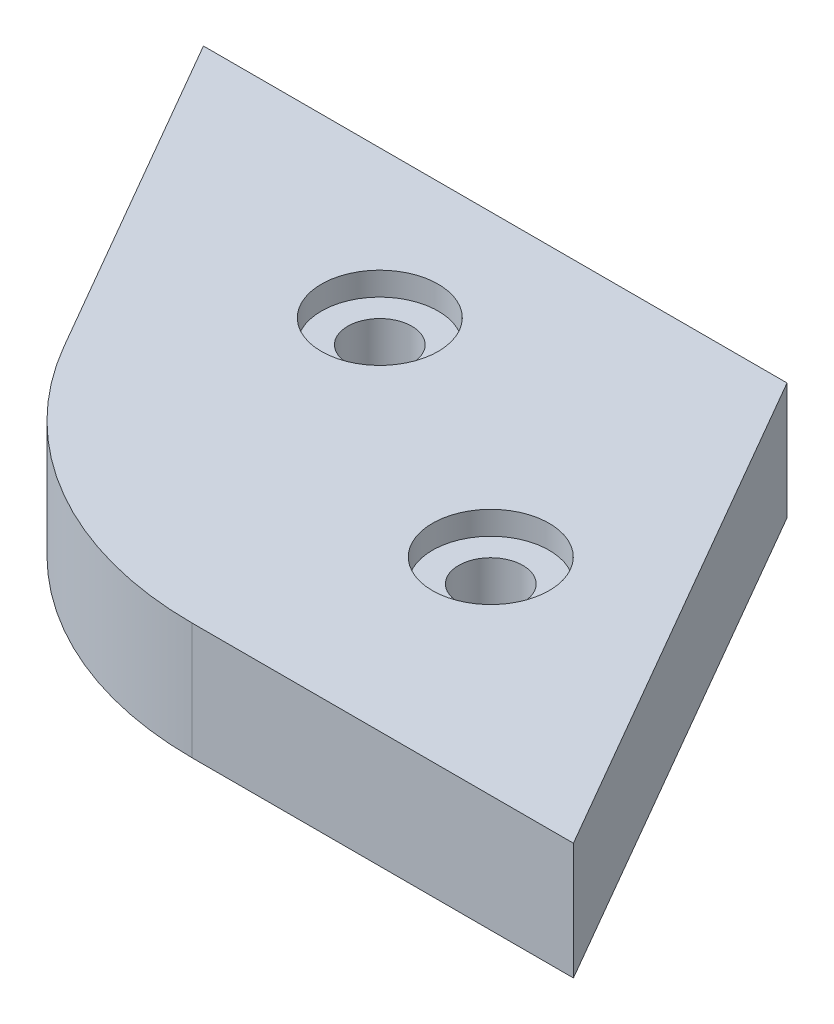
ISO-10303-21;
HEADER;
FILE_DESCRIPTION(('STEP AP214'),'2;1');
FILE_NAME('part.step','',(''),(''),'','','');
FILE_SCHEMA(('AUTOMOTIVE_DESIGN { 1 0 10303 214 1 1 1 1 }'));
ENDSEC;
DATA;
#1=APPLICATION_CONTEXT('core data for automotive mechanical design processes');
#2=APPLICATION_PROTOCOL_DEFINITION('international standard','automotive_design',2000,#1);
#3=PRODUCT_CONTEXT('',#1,'mechanical');
#4=PRODUCT('Part','Part','',(#3));
#5=PRODUCT_RELATED_PRODUCT_CATEGORY('part','',(#4));
#6=PRODUCT_DEFINITION_FORMATION('','',#4);
#7=PRODUCT_DEFINITION_CONTEXT('part definition',#1,'design');
#8=PRODUCT_DEFINITION('design','',#6,#7);
#9=PRODUCT_DEFINITION_SHAPE('','',#8);
#10=(LENGTH_UNIT() NAMED_UNIT(*) SI_UNIT(.MILLI.,.METRE.));
#11=(NAMED_UNIT(*) PLANE_ANGLE_UNIT() SI_UNIT($,.RADIAN.));
#12=(NAMED_UNIT(*) SI_UNIT($,.STERADIAN.) SOLID_ANGLE_UNIT());
#13=UNCERTAINTY_MEASURE_WITH_UNIT(LENGTH_MEASURE(1.E-05),#10,'distance_accuracy_value','');
#14=(GEOMETRIC_REPRESENTATION_CONTEXT(3) GLOBAL_UNCERTAINTY_ASSIGNED_CONTEXT((#13)) GLOBAL_UNIT_ASSIGNED_CONTEXT((#10,
#11,#12)) REPRESENTATION_CONTEXT('',''));
#15=CARTESIAN_POINT('',(0.,0.,0.));
#16=DIRECTION('',(0.,0.,1.));
#17=DIRECTION('',(1.,0.,0.));
#18=AXIS2_PLACEMENT_3D('',#15,#16,#17);
#19=CARTESIAN_POINT('',(-173.504862890413,10.,326.5));
#20=DIRECTION('',(0.,-1.,0.));
#21=DIRECTION('',(0.,0.,-1.));
#22=AXIS2_PLACEMENT_3D('',#19,#20,#21);
#23=CYLINDRICAL_SURFACE('',#22,2.75000000000001);
#24=CARTESIAN_POINT('',(-173.504862890413,0.,326.5));
#25=DIRECTION('',(0.,1.,0.));
#26=DIRECTION('',(0.,0.,1.));
#27=AXIS2_PLACEMENT_3D('',#24,#25,#26);
#28=CIRCLE('',#27,2.75000000000001);
#29=CARTESIAN_POINT('',(-173.504862890413,0.,329.25));
#30=VERTEX_POINT('',#29);
#31=EDGE_CURVE('E123',#30,#30,#28,.T.);
#32=ORIENTED_EDGE('',*,*,#31,.F.);
#33=EDGE_LOOP('',(#32));
#34=FACE_BOUND('',#33,.T.);
#35=CARTESIAN_POINT('',(-173.504862890413,8.,326.5));
#36=DIRECTION('',(0.,1.,0.));
#37=DIRECTION('',(0.,0.,1.));
#38=AXIS2_PLACEMENT_3D('',#35,#36,#37);
#39=CIRCLE('',#38,2.75000000000001);
#40=CARTESIAN_POINT('',(-173.504862890413,8.,329.25));
#41=VERTEX_POINT('',#40);
#42=EDGE_CURVE('E115',#41,#41,#39,.T.);
#43=ORIENTED_EDGE('',*,*,#42,.T.);
#44=EDGE_LOOP('',(#43));
#45=FACE_BOUND('',#44,.T.);
#46=ADVANCED_FACE('F33',(#34,#45),#23,.F.);
#47=CARTESIAN_POINT('',(-196.004862890413,10.,313.509618943234));
#48=DIRECTION('',(0.,-1.,0.));
#49=DIRECTION('',(0.,0.,-1.));
#50=AXIS2_PLACEMENT_3D('',#47,#48,#49);
#51=CYLINDRICAL_SURFACE('',#50,2.75000000000001);
#52=CARTESIAN_POINT('',(-196.004862890413,0.,313.509618943234));
#53=DIRECTION('',(0.,1.,0.));
#54=DIRECTION('',(0.,0.,1.));
#55=AXIS2_PLACEMENT_3D('',#52,#53,#54);
#56=CIRCLE('',#55,2.75000000000001);
#57=CARTESIAN_POINT('',(-196.004862890413,0.,316.259618943234));
#58=VERTEX_POINT('',#57);
#59=EDGE_CURVE('E118',#58,#58,#56,.T.);
#60=ORIENTED_EDGE('',*,*,#59,.F.);
#61=EDGE_LOOP('',(#60));
#62=FACE_BOUND('',#61,.T.);
#63=CARTESIAN_POINT('',(-196.004862890413,8.,313.509618943234));
#64=DIRECTION('',(0.,1.,0.));
#65=DIRECTION('',(0.,0.,1.));
#66=AXIS2_PLACEMENT_3D('',#63,#64,#65);
#67=CIRCLE('',#66,2.75000000000001);
#68=CARTESIAN_POINT('',(-196.004862890413,8.,316.259618943234));
#69=VERTEX_POINT('',#68);
#70=EDGE_CURVE('E112',#69,#69,#67,.T.);
#71=ORIENTED_EDGE('',*,*,#70,.T.);
#72=EDGE_LOOP('',(#71));
#73=FACE_BOUND('',#72,.T.);
#74=ADVANCED_FACE('F160',(#62,#73),#51,.F.);
#75=CARTESIAN_POINT('',(0.,10.,0.));
#76=DIRECTION('',(0.,-1.,0.));
#77=DIRECTION('',(0.,0.,-1.));
#78=AXIS2_PLACEMENT_3D('',#75,#76,#77);
#79=PLANE('',#78);
#80=CARTESIAN_POINT('',(-196.004862890413,10.,313.509618943234));
#81=DIRECTION('',(0.,1.,0.));
#82=DIRECTION('',(0.,0.,1.));
#83=AXIS2_PLACEMENT_3D('',#80,#81,#82);
#84=CIRCLE('',#83,4.99999999999999);
#85=CARTESIAN_POINT('',(-196.004862890413,10.,318.509618943234));
#86=VERTEX_POINT('',#85);
#87=EDGE_CURVE('E267',#86,#86,#84,.T.);
#88=ORIENTED_EDGE('',*,*,#87,.F.);
#89=EDGE_LOOP('',(#88));
#90=FACE_BOUND('',#89,.T.);
#91=CARTESIAN_POINT('',(-173.504862890413,10.,326.5));
#92=DIRECTION('',(0.,1.,0.));
#93=DIRECTION('',(0.,0.,1.));
#94=AXIS2_PLACEMENT_3D('',#91,#92,#93);
#95=CIRCLE('',#94,4.99999999999999);
#96=CARTESIAN_POINT('',(-173.504862890413,10.,331.5));
#97=VERTEX_POINT('',#96);
#98=EDGE_CURVE('E130',#97,#97,#95,.T.);
#99=ORIENTED_EDGE('',*,*,#98,.F.);
#100=EDGE_LOOP('',(#99));
#101=FACE_BOUND('',#100,.T.);
#102=DIRECTION('',(0.500000000000002,0.,0.866025403784438));
#103=VECTOR('',#102,1.);
#104=CARTESIAN_POINT('',(-198.723962655069,10.,344.2));
#105=LINE('',#104,#103);
#106=CARTESIAN_POINT('',(-223.723962655069,10.,300.898729810778));
#107=VERTEX_POINT('',#106);
#108=CARTESIAN_POINT('',(-207.384216692914,10.,329.2));
#109=VERTEX_POINT('',#108);
#110=EDGE_CURVE('E89',#107,#109,#105,.T.);
#111=ORIENTED_EDGE('',*,*,#110,.T.);
#112=CARTESIAN_POINT('',(-181.40345457938,10.,314.2));
#113=DIRECTION('',(0.,-1.,0.));
#114=DIRECTION('',(0.,0.,-1.));
#115=AXIS2_PLACEMENT_3D('',#112,#113,#114);
#116=CIRCLE('',#115,30.);
#117=CARTESIAN_POINT('',(-181.40345457938,10.,344.2));
#118=VERTEX_POINT('',#117);
#119=EDGE_CURVE('E11',#109,#118,#116,.F.);
#120=ORIENTED_EDGE('',*,*,#119,.T.);
#121=DIRECTION('',(1.,0.,0.));
#122=VECTOR('',#121,1.);
#123=CARTESIAN_POINT('',(-148.723962655069,10.,344.2));
#124=LINE('',#123,#122);
#125=CARTESIAN_POINT('',(-148.723962655069,10.,344.2));
#126=VERTEX_POINT('',#125);
#127=EDGE_CURVE('E95',#118,#126,#124,.T.);
#128=ORIENTED_EDGE('',*,*,#127,.T.);
#129=DIRECTION('',(-0.500000000000001,0.,-0.866025403784438));
#130=VECTOR('',#129,1.);
#131=CARTESIAN_POINT('',(-173.723962655069,10.,300.898729810778));
#132=LINE('',#131,#130);
#133=CARTESIAN_POINT('',(-173.723962655069,10.,300.898729810778));
#134=VERTEX_POINT('',#133);
#135=EDGE_CURVE('E90',#126,#134,#132,.T.);
#136=ORIENTED_EDGE('',*,*,#135,.T.);
#137=DIRECTION('',(-1.,0.,0.));
#138=VECTOR('',#137,1.);
#139=CARTESIAN_POINT('',(-223.723962655069,10.,300.898729810778));
#140=LINE('',#139,#138);
#141=EDGE_CURVE('E80',#134,#107,#140,.T.);
#142=ORIENTED_EDGE('',*,*,#141,.T.);
#143=EDGE_LOOP('',(#111,#120,#128,#136,#142));
#144=FACE_BOUND('',#143,.T.);
#145=ADVANCED_FACE('F93',(#90,#101,#144),#79,.F.);
#146=CARTESIAN_POINT('',(0.,0.,0.));
#147=DIRECTION('',(0.,-1.,0.));
#148=DIRECTION('',(0.,0.,-1.));
#149=AXIS2_PLACEMENT_3D('',#146,#147,#148);
#150=PLANE('',#149);
#151=ORIENTED_EDGE('',*,*,#31,.T.);
#152=EDGE_LOOP('',(#151));
#153=FACE_BOUND('',#152,.T.);
#154=DIRECTION('',(1.,0.,0.));
#155=VECTOR('',#154,1.);
#156=CARTESIAN_POINT('',(-148.723962655069,0.,344.2));
#157=LINE('',#156,#155);
#158=CARTESIAN_POINT('',(-181.40345457938,0.,344.2));
#159=VERTEX_POINT('',#158);
#160=CARTESIAN_POINT('',(-148.723962655069,0.,344.2));
#161=VERTEX_POINT('',#160);
#162=EDGE_CURVE('E99',#159,#161,#157,.T.);
#163=ORIENTED_EDGE('',*,*,#162,.F.);
#164=CARTESIAN_POINT('',(-181.40345457938,0.,314.2));
#165=DIRECTION('',(0.,-1.,0.));
#166=DIRECTION('',(0.,0.,-1.));
#167=AXIS2_PLACEMENT_3D('',#164,#165,#166);
#168=CIRCLE('',#167,30.);
#169=CARTESIAN_POINT('',(-207.384216692914,0.,329.2));
#170=VERTEX_POINT('',#169);
#171=EDGE_CURVE('E55',#159,#170,#168,.T.);
#172=ORIENTED_EDGE('',*,*,#171,.T.);
#173=DIRECTION('',(0.500000000000002,0.,0.866025403784438));
#174=VECTOR('',#173,1.);
#175=CARTESIAN_POINT('',(-198.723962655069,0.,344.2));
#176=LINE('',#175,#174);
#177=CARTESIAN_POINT('',(-223.723962655069,0.,300.898729810778));
#178=VERTEX_POINT('',#177);
#179=EDGE_CURVE('E138',#178,#170,#176,.T.);
#180=ORIENTED_EDGE('',*,*,#179,.F.);
#181=DIRECTION('',(-1.,0.,0.));
#182=VECTOR('',#181,1.);
#183=CARTESIAN_POINT('',(-223.723962655069,0.,300.898729810778));
#184=LINE('',#183,#182);
#185=CARTESIAN_POINT('',(-173.723962655069,0.,300.898729810778));
#186=VERTEX_POINT('',#185);
#187=EDGE_CURVE('E136',#186,#178,#184,.T.);
#188=ORIENTED_EDGE('',*,*,#187,.F.);
#189=DIRECTION('',(-0.500000000000001,0.,-0.866025403784438));
#190=VECTOR('',#189,1.);
#191=CARTESIAN_POINT('',(-173.723962655069,0.,300.898729810778));
#192=LINE('',#191,#190);
#193=EDGE_CURVE('E103',#161,#186,#192,.T.);
#194=ORIENTED_EDGE('',*,*,#193,.F.);
#195=EDGE_LOOP('',(#163,#172,#180,#188,#194));
#196=FACE_BOUND('',#195,.T.);
#197=ORIENTED_EDGE('',*,*,#59,.T.);
#198=EDGE_LOOP('',(#197));
#199=FACE_BOUND('',#198,.T.);
#200=ADVANCED_FACE('F141',(#153,#196,#199),#150,.T.);
#201=CARTESIAN_POINT('',(-173.723962655069,10.,300.898729810778));
#202=DIRECTION('',(-0.866025403784438,0.,0.500000000000001));
#203=DIRECTION('',(0.500000000000001,0.,0.866025403784438));
#204=AXIS2_PLACEMENT_3D('',#201,#202,#203);
#205=PLANE('',#204);
#206=ORIENTED_EDGE('',*,*,#193,.T.);
#207=DIRECTION('',(0.,-1.,0.));
#208=VECTOR('',#207,1.);
#209=CARTESIAN_POINT('',(-173.723962655069,10.,300.898729810778));
#210=LINE('',#209,#208);
#211=EDGE_CURVE('E84',#134,#186,#210,.T.);
#212=ORIENTED_EDGE('',*,*,#211,.F.);
#213=ORIENTED_EDGE('',*,*,#135,.F.);
#214=DIRECTION('',(0.,-1.,0.));
#215=VECTOR('',#214,1.);
#216=CARTESIAN_POINT('',(-148.723962655069,10.,344.2));
#217=LINE('',#216,#215);
#218=EDGE_CURVE('E108',#126,#161,#217,.T.);
#219=ORIENTED_EDGE('',*,*,#218,.T.);
#220=EDGE_LOOP('',(#206,#212,#213,#219));
#221=FACE_BOUND('',#220,.T.);
#222=ADVANCED_FACE('F101',(#221),#205,.F.);
#223=CARTESIAN_POINT('',(-223.723962655069,10.,300.898729810778));
#224=DIRECTION('',(0.,0.,1.));
#225=DIRECTION('',(1.,0.,0.));
#226=AXIS2_PLACEMENT_3D('',#223,#224,#225);
#227=PLANE('',#226);
#228=ORIENTED_EDGE('',*,*,#187,.T.);
#229=DIRECTION('',(0.,-1.,0.));
#230=VECTOR('',#229,1.);
#231=CARTESIAN_POINT('',(-223.723962655069,10.,300.898729810778));
#232=LINE('',#231,#230);
#233=EDGE_CURVE('E87',#107,#178,#232,.T.);
#234=ORIENTED_EDGE('',*,*,#233,.F.);
#235=ORIENTED_EDGE('',*,*,#141,.F.);
#236=ORIENTED_EDGE('',*,*,#211,.T.);
#237=EDGE_LOOP('',(#228,#234,#235,#236));
#238=FACE_BOUND('',#237,.T.);
#239=ADVANCED_FACE('F82',(#238),#227,.F.);
#240=CARTESIAN_POINT('',(-198.723962655069,10.,344.2));
#241=DIRECTION('',(0.866025403784438,0.,-0.500000000000002));
#242=DIRECTION('',(-0.500000000000002,0.,-0.866025403784438));
#243=AXIS2_PLACEMENT_3D('',#240,#241,#242);
#244=PLANE('',#243);
#245=ORIENTED_EDGE('',*,*,#179,.T.);
#246=DIRECTION('',(0.,-1.,0.));
#247=VECTOR('',#246,1.);
#248=CARTESIAN_POINT('',(-207.384216692914,10.,329.2));
#249=LINE('',#248,#247);
#250=EDGE_CURVE('E41',#170,#109,#249,.F.);
#251=ORIENTED_EDGE('',*,*,#250,.T.);
#252=ORIENTED_EDGE('',*,*,#110,.F.);
#253=ORIENTED_EDGE('',*,*,#233,.T.);
#254=EDGE_LOOP('',(#245,#251,#252,#253));
#255=FACE_BOUND('',#254,.T.);
#256=ADVANCED_FACE('F142',(#255),#244,.F.);
#257=CARTESIAN_POINT('',(-148.723962655069,10.,344.2));
#258=DIRECTION('',(0.,0.,-1.));
#259=DIRECTION('',(-1.,0.,0.));
#260=AXIS2_PLACEMENT_3D('',#257,#258,#259);
#261=PLANE('',#260);
#262=ORIENTED_EDGE('',*,*,#127,.F.);
#263=DIRECTION('',(0.,-1.,0.));
#264=VECTOR('',#263,1.);
#265=CARTESIAN_POINT('',(-181.40345457938,10.,344.2));
#266=LINE('',#265,#264);
#267=EDGE_CURVE('E104',#118,#159,#266,.T.);
#268=ORIENTED_EDGE('',*,*,#267,.T.);
#269=ORIENTED_EDGE('',*,*,#162,.T.);
#270=ORIENTED_EDGE('',*,*,#218,.F.);
#271=EDGE_LOOP('',(#262,#268,#269,#270));
#272=FACE_BOUND('',#271,.T.);
#273=ADVANCED_FACE('F146',(#272),#261,.F.);
#274=CARTESIAN_POINT('',(-196.004862890413,8.,313.509618943234));
#275=DIRECTION('',(0.,1.,0.));
#276=DIRECTION('',(0.,0.,1.));
#277=AXIS2_PLACEMENT_3D('',#274,#275,#276);
#278=CYLINDRICAL_SURFACE('',#277,4.99999999999999);
#279=CARTESIAN_POINT('',(-196.004862890413,8.,313.509618943234));
#280=DIRECTION('',(0.,1.,0.));
#281=DIRECTION('',(0.,0.,1.));
#282=AXIS2_PLACEMENT_3D('',#279,#280,#281);
#283=CIRCLE('',#282,4.99999999999999);
#284=CARTESIAN_POINT('',(-196.004862890413,8.,318.509618943234));
#285=VERTEX_POINT('',#284);
#286=EDGE_CURVE('E116',#285,#285,#283,.T.);
#287=ORIENTED_EDGE('',*,*,#286,.F.);
#288=EDGE_LOOP('',(#287));
#289=FACE_BOUND('',#288,.T.);
#290=ORIENTED_EDGE('',*,*,#87,.T.);
#291=EDGE_LOOP('',(#290));
#292=FACE_BOUND('',#291,.T.);
#293=ADVANCED_FACE('F148',(#289,#292),#278,.F.);
#294=CARTESIAN_POINT('',(-196.004862890413,8.,313.509618943234));
#295=DIRECTION('',(0.,1.,0.));
#296=DIRECTION('',(0.,0.,1.));
#297=AXIS2_PLACEMENT_3D('',#294,#295,#296);
#298=PLANE('',#297);
#299=ORIENTED_EDGE('',*,*,#70,.F.);
#300=EDGE_LOOP('',(#299));
#301=FACE_BOUND('',#300,.T.);
#302=ORIENTED_EDGE('',*,*,#286,.T.);
#303=EDGE_LOOP('',(#302));
#304=FACE_BOUND('',#303,.T.);
#305=ADVANCED_FACE('F154',(#301,#304),#298,.T.);
#306=CARTESIAN_POINT('',(-173.504862890413,8.,326.5));
#307=DIRECTION('',(0.,1.,0.));
#308=DIRECTION('',(0.,0.,1.));
#309=AXIS2_PLACEMENT_3D('',#306,#307,#308);
#310=CYLINDRICAL_SURFACE('',#309,4.99999999999999);
#311=CARTESIAN_POINT('',(-173.504862890413,8.,326.5));
#312=DIRECTION('',(0.,1.,0.));
#313=DIRECTION('',(0.,0.,1.));
#314=AXIS2_PLACEMENT_3D('',#311,#312,#313);
#315=CIRCLE('',#314,4.99999999999999);
#316=CARTESIAN_POINT('',(-173.504862890413,8.,331.5));
#317=VERTEX_POINT('',#316);
#318=EDGE_CURVE('E270',#317,#317,#315,.T.);
#319=ORIENTED_EDGE('',*,*,#318,.F.);
#320=EDGE_LOOP('',(#319));
#321=FACE_BOUND('',#320,.T.);
#322=ORIENTED_EDGE('',*,*,#98,.T.);
#323=EDGE_LOOP('',(#322));
#324=FACE_BOUND('',#323,.T.);
#325=ADVANCED_FACE('F213',(#321,#324),#310,.F.);
#326=CARTESIAN_POINT('',(-173.504862890413,8.,326.5));
#327=DIRECTION('',(0.,1.,0.));
#328=DIRECTION('',(0.,0.,1.));
#329=AXIS2_PLACEMENT_3D('',#326,#327,#328);
#330=PLANE('',#329);
#331=ORIENTED_EDGE('',*,*,#42,.F.);
#332=EDGE_LOOP('',(#331));
#333=FACE_BOUND('',#332,.T.);
#334=ORIENTED_EDGE('',*,*,#318,.T.);
#335=EDGE_LOOP('',(#334));
#336=FACE_BOUND('',#335,.T.);
#337=ADVANCED_FACE('F204',(#333,#336),#330,.T.);
#338=CARTESIAN_POINT('',(-181.40345457938,10.,314.2));
#339=DIRECTION('',(0.,-1.,0.));
#340=DIRECTION('',(0.,0.,-1.));
#341=AXIS2_PLACEMENT_3D('',#338,#339,#340);
#342=CYLINDRICAL_SURFACE('',#341,30.);
#343=ORIENTED_EDGE('',*,*,#119,.F.);
#344=ORIENTED_EDGE('',*,*,#250,.F.);
#345=ORIENTED_EDGE('',*,*,#171,.F.);
#346=ORIENTED_EDGE('',*,*,#267,.F.);
#347=EDGE_LOOP('',(#343,#344,#345,#346));
#348=FACE_BOUND('',#347,.T.);
#349=ADVANCED_FACE('F35',(#348),#342,.T.);
#350=CLOSED_SHELL('',(#46,#74,#145,#200,#222,#239,#256,#273,#293,#305,#325,#337,#349));
#351=MANIFOLD_SOLID_BREP('B2',#350);
#352=ADVANCED_BREP_SHAPE_REPRESENTATION('',(#18,#351),#14);
#353=SHAPE_DEFINITION_REPRESENTATION(#9,#352);
ENDSEC;
END-ISO-10303-21;
